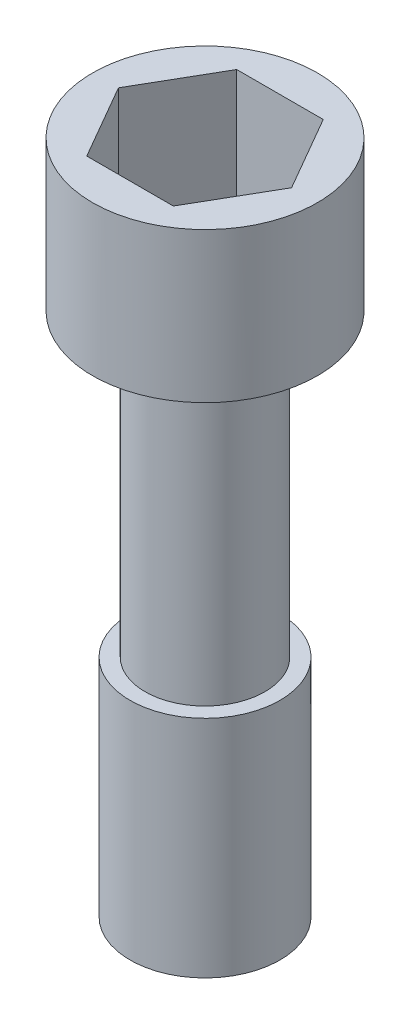
ISO-10303-21;
HEADER;
FILE_DESCRIPTION(('STEP AP214'),'2;1');
FILE_NAME('part.step','',(''),(''),'','','');
FILE_SCHEMA(('AUTOMOTIVE_DESIGN { 1 0 10303 214 1 1 1 1 }'));
ENDSEC;
DATA;
#1=APPLICATION_CONTEXT('core data for automotive mechanical design processes');
#2=APPLICATION_PROTOCOL_DEFINITION('international standard','automotive_design',2000,#1);
#3=PRODUCT_CONTEXT('',#1,'mechanical');
#4=PRODUCT('Part','Part','',(#3));
#5=PRODUCT_RELATED_PRODUCT_CATEGORY('part','',(#4));
#6=PRODUCT_DEFINITION_FORMATION('','',#4);
#7=PRODUCT_DEFINITION_CONTEXT('part definition',#1,'design');
#8=PRODUCT_DEFINITION('design','',#6,#7);
#9=PRODUCT_DEFINITION_SHAPE('','',#8);
#10=(LENGTH_UNIT() NAMED_UNIT(*) SI_UNIT(.MILLI.,.METRE.));
#11=(NAMED_UNIT(*) PLANE_ANGLE_UNIT() SI_UNIT($,.RADIAN.));
#12=(NAMED_UNIT(*) SI_UNIT($,.STERADIAN.) SOLID_ANGLE_UNIT());
#13=UNCERTAINTY_MEASURE_WITH_UNIT(LENGTH_MEASURE(1.E-05),#10,'distance_accuracy_value','');
#14=(GEOMETRIC_REPRESENTATION_CONTEXT(3) GLOBAL_UNCERTAINTY_ASSIGNED_CONTEXT((#13)) GLOBAL_UNIT_ASSIGNED_CONTEXT((#10,
#11,#12)) REPRESENTATION_CONTEXT('',''));
#15=CARTESIAN_POINT('',(0.,0.,0.));
#16=DIRECTION('',(0.,0.,1.));
#17=DIRECTION('',(1.,0.,0.));
#18=AXIS2_PLACEMENT_3D('',#15,#16,#17);
#19=CARTESIAN_POINT('',(0.,8.,0.));
#20=DIRECTION('',(0.,1.,0.));
#21=DIRECTION('',(0.,0.,1.));
#22=AXIS2_PLACEMENT_3D('',#19,#20,#21);
#23=PLANE('',#22);
#24=CARTESIAN_POINT('',(0.,8.,0.));
#25=DIRECTION('',(0.,1.,0.));
#26=DIRECTION('',(0.,0.,1.));
#27=AXIS2_PLACEMENT_3D('',#24,#25,#26);
#28=CIRCLE('',#27,7.5);
#29=CARTESIAN_POINT('',(0.,8.,7.5));
#30=VERTEX_POINT('',#29);
#31=EDGE_CURVE('E47',#30,#30,#28,.T.);
#32=ORIENTED_EDGE('',*,*,#31,.T.);
#33=EDGE_LOOP('',(#32));
#34=FACE_BOUND('',#33,.T.);
#35=DIRECTION('',(-0.500000000000001,0.,-0.866025403784438));
#36=VECTOR('',#35,1.);
#37=CARTESIAN_POINT('',(5.77350269189626,8.,0.));
#38=LINE('',#37,#36);
#39=CARTESIAN_POINT('',(5.77350269189626,8.,0.));
#40=VERTEX_POINT('',#39);
#41=CARTESIAN_POINT('',(2.88675134594812,8.,-5.00000000000001));
#42=VERTEX_POINT('',#41);
#43=EDGE_CURVE('E116',#40,#42,#38,.T.);
#44=ORIENTED_EDGE('',*,*,#43,.F.);
#45=DIRECTION('',(0.499999999999995,0.,-0.866025403784441));
#46=VECTOR('',#45,1.);
#47=CARTESIAN_POINT('',(2.88675134594819,8.,4.99999999999997));
#48=LINE('',#47,#46);
#49=CARTESIAN_POINT('',(2.88675134594819,8.,4.99999999999997));
#50=VERTEX_POINT('',#49);
#51=EDGE_CURVE('E95',#50,#40,#48,.T.);
#52=ORIENTED_EDGE('',*,*,#51,.F.);
#53=DIRECTION('',(1.,0.,0.));
#54=VECTOR('',#53,1.);
#55=CARTESIAN_POINT('',(-2.88675134594808,8.,5.00000000000003));
#56=LINE('',#55,#54);
#57=CARTESIAN_POINT('',(-2.88675134594808,8.,5.00000000000003));
#58=VERTEX_POINT('',#57);
#59=EDGE_CURVE('E66',#58,#50,#56,.T.);
#60=ORIENTED_EDGE('',*,*,#59,.F.);
#61=DIRECTION('',(0.500000000000007,0.,0.866025403784435));
#62=VECTOR('',#61,1.);
#63=CARTESIAN_POINT('',(-5.77350269189626,8.,0.));
#64=LINE('',#63,#62);
#65=CARTESIAN_POINT('',(-5.77350269189626,8.,0.));
#66=VERTEX_POINT('',#65);
#67=EDGE_CURVE('E128',#66,#58,#64,.T.);
#68=ORIENTED_EDGE('',*,*,#67,.F.);
#69=DIRECTION('',(-0.499999999999995,0.,0.866025403784441));
#70=VECTOR('',#69,1.);
#71=CARTESIAN_POINT('',(-2.88675134594815,8.,-4.99999999999999));
#72=LINE('',#71,#70);
#73=CARTESIAN_POINT('',(-2.88675134594815,8.,-4.99999999999999));
#74=VERTEX_POINT('',#73);
#75=EDGE_CURVE('E115',#74,#66,#72,.T.);
#76=ORIENTED_EDGE('',*,*,#75,.F.);
#77=DIRECTION('',(-1.,0.,0.));
#78=VECTOR('',#77,1.);
#79=CARTESIAN_POINT('',(2.88675134594812,8.,-5.00000000000001));
#80=LINE('',#79,#78);
#81=EDGE_CURVE('E104',#42,#74,#80,.T.);
#82=ORIENTED_EDGE('',*,*,#81,.F.);
#83=EDGE_LOOP('',(#44,#52,#60,#68,#76,#82));
#84=FACE_BOUND('',#83,.T.);
#85=ADVANCED_FACE('F43',(#34,#84),#23,.T.);
#86=CARTESIAN_POINT('',(0.,8.,0.));
#87=DIRECTION('',(0.,-1.,0.));
#88=DIRECTION('',(0.,0.,-1.));
#89=AXIS2_PLACEMENT_3D('',#86,#87,#88);
#90=CYLINDRICAL_SURFACE('',#89,7.5);
#91=ORIENTED_EDGE('',*,*,#31,.F.);
#92=EDGE_LOOP('',(#91));
#93=FACE_BOUND('',#92,.T.);
#94=CARTESIAN_POINT('',(0.,-2.,0.));
#95=DIRECTION('',(0.,-1.,0.));
#96=DIRECTION('',(0.,0.,-1.));
#97=AXIS2_PLACEMENT_3D('',#94,#95,#96);
#98=CIRCLE('',#97,7.5);
#99=CARTESIAN_POINT('',(0.,-2.,-7.5));
#100=VERTEX_POINT('',#99);
#101=EDGE_CURVE('E143',#100,#100,#98,.T.);
#102=ORIENTED_EDGE('',*,*,#101,.F.);
#103=EDGE_LOOP('',(#102));
#104=FACE_BOUND('',#103,.T.);
#105=ADVANCED_FACE('F45',(#93,#104),#90,.T.);
#106=CARTESIAN_POINT('',(2.88675134594819,8.,4.99999999999997));
#107=DIRECTION('',(-0.866025403784441,0.,-0.499999999999995));
#108=DIRECTION('',(-0.499999999999995,0.,0.866025403784442));
#109=AXIS2_PLACEMENT_3D('',#106,#107,#108);
#110=PLANE('',#109);
#111=DIRECTION('',(0.499999999999995,0.,-0.866025403784441));
#112=VECTOR('',#111,1.);
#113=CARTESIAN_POINT('',(2.88675134594819,0.,4.99999999999997));
#114=LINE('',#113,#112);
#115=CARTESIAN_POINT('',(2.88675134594819,0.,4.99999999999997));
#116=VERTEX_POINT('',#115);
#117=CARTESIAN_POINT('',(5.77350269189626,0.,0.));
#118=VERTEX_POINT('',#117);
#119=EDGE_CURVE('E138',#116,#118,#114,.T.);
#120=ORIENTED_EDGE('',*,*,#119,.F.);
#121=DIRECTION('',(0.,-1.,0.));
#122=VECTOR('',#121,1.);
#123=CARTESIAN_POINT('',(2.88675134594819,8.,4.99999999999997));
#124=LINE('',#123,#122);
#125=EDGE_CURVE('E137',#50,#116,#124,.T.);
#126=ORIENTED_EDGE('',*,*,#125,.F.);
#127=ORIENTED_EDGE('',*,*,#51,.T.);
#128=DIRECTION('',(0.,-1.,0.));
#129=VECTOR('',#128,1.);
#130=CARTESIAN_POINT('',(5.77350269189626,8.,0.));
#131=LINE('',#130,#129);
#132=EDGE_CURVE('E167',#40,#118,#131,.T.);
#133=ORIENTED_EDGE('',*,*,#132,.T.);
#134=EDGE_LOOP('',(#120,#126,#127,#133));
#135=FACE_BOUND('',#134,.T.);
#136=ADVANCED_FACE('F177',(#135),#110,.T.);
#137=CARTESIAN_POINT('',(5.77350269189626,8.,0.));
#138=DIRECTION('',(-0.866025403784438,0.,0.500000000000001));
#139=DIRECTION('',(0.500000000000001,0.,0.866025403784438));
#140=AXIS2_PLACEMENT_3D('',#137,#138,#139);
#141=PLANE('',#140);
#142=DIRECTION('',(-0.500000000000001,0.,-0.866025403784438));
#143=VECTOR('',#142,1.);
#144=CARTESIAN_POINT('',(5.77350269189626,0.,0.));
#145=LINE('',#144,#143);
#146=CARTESIAN_POINT('',(2.88675134594812,0.,-5.00000000000001));
#147=VERTEX_POINT('',#146);
#148=EDGE_CURVE('E142',#118,#147,#145,.T.);
#149=ORIENTED_EDGE('',*,*,#148,.F.);
#150=ORIENTED_EDGE('',*,*,#132,.F.);
#151=ORIENTED_EDGE('',*,*,#43,.T.);
#152=DIRECTION('',(0.,-1.,0.));
#153=VECTOR('',#152,1.);
#154=CARTESIAN_POINT('',(2.88675134594812,8.,-5.00000000000001));
#155=LINE('',#154,#153);
#156=EDGE_CURVE('E110',#42,#147,#155,.T.);
#157=ORIENTED_EDGE('',*,*,#156,.T.);
#158=EDGE_LOOP('',(#149,#150,#151,#157));
#159=FACE_BOUND('',#158,.T.);
#160=ADVANCED_FACE('F192',(#159),#141,.T.);
#161=CARTESIAN_POINT('',(2.88675134594812,8.,-5.00000000000001));
#162=DIRECTION('',(0.,0.,1.));
#163=DIRECTION('',(1.,0.,0.));
#164=AXIS2_PLACEMENT_3D('',#161,#162,#163);
#165=PLANE('',#164);
#166=DIRECTION('',(-1.,0.,0.));
#167=VECTOR('',#166,1.);
#168=CARTESIAN_POINT('',(2.88675134594812,0.,-5.00000000000001));
#169=LINE('',#168,#167);
#170=CARTESIAN_POINT('',(-2.88675134594815,0.,-4.99999999999999));
#171=VERTEX_POINT('',#170);
#172=EDGE_CURVE('E147',#147,#171,#169,.T.);
#173=ORIENTED_EDGE('',*,*,#172,.F.);
#174=ORIENTED_EDGE('',*,*,#156,.F.);
#175=ORIENTED_EDGE('',*,*,#81,.T.);
#176=DIRECTION('',(0.,-1.,0.));
#177=VECTOR('',#176,1.);
#178=CARTESIAN_POINT('',(-2.88675134594815,8.,-4.99999999999999));
#179=LINE('',#178,#177);
#180=EDGE_CURVE('E108',#74,#171,#179,.T.);
#181=ORIENTED_EDGE('',*,*,#180,.T.);
#182=EDGE_LOOP('',(#173,#174,#175,#181));
#183=FACE_BOUND('',#182,.T.);
#184=ADVANCED_FACE('F107',(#183),#165,.T.);
#185=CARTESIAN_POINT('',(-2.88675134594815,8.,-4.99999999999999));
#186=DIRECTION('',(0.866025403784442,0.,0.499999999999995));
#187=DIRECTION('',(0.499999999999995,0.,-0.866025403784442));
#188=AXIS2_PLACEMENT_3D('',#185,#186,#187);
#189=PLANE('',#188);
#190=DIRECTION('',(-0.499999999999995,0.,0.866025403784441));
#191=VECTOR('',#190,1.);
#192=CARTESIAN_POINT('',(-2.88675134594815,0.,-4.99999999999999));
#193=LINE('',#192,#191);
#194=CARTESIAN_POINT('',(-5.77350269189626,0.,0.));
#195=VERTEX_POINT('',#194);
#196=EDGE_CURVE('E122',#171,#195,#193,.T.);
#197=ORIENTED_EDGE('',*,*,#196,.F.);
#198=ORIENTED_EDGE('',*,*,#180,.F.);
#199=ORIENTED_EDGE('',*,*,#75,.T.);
#200=DIRECTION('',(0.,-1.,0.));
#201=VECTOR('',#200,1.);
#202=CARTESIAN_POINT('',(-5.77350269189626,8.,0.));
#203=LINE('',#202,#201);
#204=EDGE_CURVE('E125',#66,#195,#203,.T.);
#205=ORIENTED_EDGE('',*,*,#204,.T.);
#206=EDGE_LOOP('',(#197,#198,#199,#205));
#207=FACE_BOUND('',#206,.T.);
#208=ADVANCED_FACE('F119',(#207),#189,.T.);
#209=CARTESIAN_POINT('',(-5.77350269189626,8.,0.));
#210=DIRECTION('',(0.866025403784435,0.,-0.500000000000007));
#211=DIRECTION('',(-0.500000000000007,0.,-0.866025403784435));
#212=AXIS2_PLACEMENT_3D('',#209,#210,#211);
#213=PLANE('',#212);
#214=DIRECTION('',(0.500000000000007,0.,0.866025403784435));
#215=VECTOR('',#214,1.);
#216=CARTESIAN_POINT('',(-5.77350269189626,0.,0.));
#217=LINE('',#216,#215);
#218=CARTESIAN_POINT('',(-2.88675134594808,0.,5.00000000000003));
#219=VERTEX_POINT('',#218);
#220=EDGE_CURVE('E152',#195,#219,#217,.T.);
#221=ORIENTED_EDGE('',*,*,#220,.F.);
#222=ORIENTED_EDGE('',*,*,#204,.F.);
#223=ORIENTED_EDGE('',*,*,#67,.T.);
#224=DIRECTION('',(0.,-1.,0.));
#225=VECTOR('',#224,1.);
#226=CARTESIAN_POINT('',(-2.88675134594808,8.,5.00000000000003));
#227=LINE('',#226,#225);
#228=EDGE_CURVE('E60',#58,#219,#227,.T.);
#229=ORIENTED_EDGE('',*,*,#228,.T.);
#230=EDGE_LOOP('',(#221,#222,#223,#229));
#231=FACE_BOUND('',#230,.T.);
#232=ADVANCED_FACE('F196',(#231),#213,.T.);
#233=CARTESIAN_POINT('',(-2.88675134594808,8.,5.00000000000003));
#234=DIRECTION('',(0.,0.,-1.));
#235=DIRECTION('',(-1.,0.,0.));
#236=AXIS2_PLACEMENT_3D('',#233,#234,#235);
#237=PLANE('',#236);
#238=DIRECTION('',(1.,0.,0.));
#239=VECTOR('',#238,1.);
#240=CARTESIAN_POINT('',(-2.88675134594808,0.,5.00000000000003));
#241=LINE('',#240,#239);
#242=EDGE_CURVE('E156',#219,#116,#241,.T.);
#243=ORIENTED_EDGE('',*,*,#242,.F.);
#244=ORIENTED_EDGE('',*,*,#228,.F.);
#245=ORIENTED_EDGE('',*,*,#59,.T.);
#246=ORIENTED_EDGE('',*,*,#125,.T.);
#247=EDGE_LOOP('',(#243,#244,#245,#246));
#248=FACE_BOUND('',#247,.T.);
#249=ADVANCED_FACE('F195',(#248),#237,.T.);
#250=CARTESIAN_POINT('',(0.,0.,0.));
#251=DIRECTION('',(0.,-1.,0.));
#252=DIRECTION('',(0.,0.,-1.));
#253=AXIS2_PLACEMENT_3D('',#250,#251,#252);
#254=PLANE('',#253);
#255=ORIENTED_EDGE('',*,*,#242,.T.);
#256=ORIENTED_EDGE('',*,*,#119,.T.);
#257=ORIENTED_EDGE('',*,*,#148,.T.);
#258=ORIENTED_EDGE('',*,*,#172,.T.);
#259=ORIENTED_EDGE('',*,*,#196,.T.);
#260=ORIENTED_EDGE('',*,*,#220,.T.);
#261=EDGE_LOOP('',(#255,#256,#257,#258,#259,#260));
#262=FACE_BOUND('',#261,.T.);
#263=ADVANCED_FACE('F194',(#262),#254,.F.);
#264=CARTESIAN_POINT('',(0.,-2.,0.));
#265=DIRECTION('',(0.,-1.,0.));
#266=DIRECTION('',(0.,0.,-1.));
#267=AXIS2_PLACEMENT_3D('',#264,#265,#266);
#268=PLANE('',#267);
#269=CARTESIAN_POINT('',(0.,-2.,0.));
#270=DIRECTION('',(0.,-1.,0.));
#271=DIRECTION('',(0.,0.,-1.));
#272=AXIS2_PLACEMENT_3D('',#269,#270,#271);
#273=CIRCLE('',#272,4.);
#274=CARTESIAN_POINT('',(0.,-2.,-4.));
#275=VERTEX_POINT('',#274);
#276=EDGE_CURVE('E11',#275,#275,#273,.T.);
#277=ORIENTED_EDGE('',*,*,#276,.F.);
#278=EDGE_LOOP('',(#277));
#279=FACE_BOUND('',#278,.T.);
#280=ORIENTED_EDGE('',*,*,#101,.T.);
#281=EDGE_LOOP('',(#280));
#282=FACE_BOUND('',#281,.T.);
#283=ADVANCED_FACE('F245',(#279,#282),#268,.T.);
#284=CARTESIAN_POINT('',(0.,-22.,0.));
#285=DIRECTION('',(0.,1.,0.));
#286=DIRECTION('',(0.,0.,1.));
#287=AXIS2_PLACEMENT_3D('',#284,#285,#286);
#288=CYLINDRICAL_SURFACE('',#287,4.);
#289=CARTESIAN_POINT('',(0.,-22.,0.));
#290=DIRECTION('',(0.,-1.,0.));
#291=DIRECTION('',(0.,0.,-1.));
#292=AXIS2_PLACEMENT_3D('',#289,#290,#291);
#293=CIRCLE('',#292,4.);
#294=CARTESIAN_POINT('',(0.,-22.,-4.));
#295=VERTEX_POINT('',#294);
#296=EDGE_CURVE('E182',#295,#295,#293,.T.);
#297=ORIENTED_EDGE('',*,*,#296,.F.);
#298=EDGE_LOOP('',(#297));
#299=FACE_BOUND('',#298,.T.);
#300=ORIENTED_EDGE('',*,*,#276,.T.);
#301=EDGE_LOOP('',(#300));
#302=FACE_BOUND('',#301,.T.);
#303=ADVANCED_FACE('F255',(#299,#302),#288,.T.);
#304=CARTESIAN_POINT('',(0.,-37.,0.));
#305=DIRECTION('',(0.,1.,0.));
#306=DIRECTION('',(0.,0.,1.));
#307=AXIS2_PLACEMENT_3D('',#304,#305,#306);
#308=CYLINDRICAL_SURFACE('',#307,5.);
#309=CARTESIAN_POINT('',(0.,-37.,0.));
#310=DIRECTION('',(0.,-1.,0.));
#311=DIRECTION('',(0.,0.,-1.));
#312=AXIS2_PLACEMENT_3D('',#309,#310,#311);
#313=CIRCLE('',#312,5.);
#314=CARTESIAN_POINT('',(0.,-37.,-5.));
#315=VERTEX_POINT('',#314);
#316=EDGE_CURVE('E186',#315,#315,#313,.T.);
#317=ORIENTED_EDGE('',*,*,#316,.F.);
#318=EDGE_LOOP('',(#317));
#319=FACE_BOUND('',#318,.T.);
#320=CARTESIAN_POINT('',(0.,-22.,0.));
#321=DIRECTION('',(0.,-1.,0.));
#322=DIRECTION('',(0.,0.,-1.));
#323=AXIS2_PLACEMENT_3D('',#320,#321,#322);
#324=CIRCLE('',#323,5.);
#325=CARTESIAN_POINT('',(0.,-22.,-5.));
#326=VERTEX_POINT('',#325);
#327=EDGE_CURVE('E351',#326,#326,#324,.T.);
#328=ORIENTED_EDGE('',*,*,#327,.T.);
#329=EDGE_LOOP('',(#328));
#330=FACE_BOUND('',#329,.T.);
#331=ADVANCED_FACE('F266',(#319,#330),#308,.T.);
#332=CARTESIAN_POINT('',(0.,-37.,0.));
#333=DIRECTION('',(0.,-1.,0.));
#334=DIRECTION('',(0.,0.,-1.));
#335=AXIS2_PLACEMENT_3D('',#332,#333,#334);
#336=PLANE('',#335);
#337=ORIENTED_EDGE('',*,*,#316,.T.);
#338=EDGE_LOOP('',(#337));
#339=FACE_BOUND('',#338,.T.);
#340=ADVANCED_FACE('F277',(#339),#336,.T.);
#341=CARTESIAN_POINT('',(0.,-22.,0.));
#342=DIRECTION('',(0.,-1.,0.));
#343=DIRECTION('',(0.,0.,-1.));
#344=AXIS2_PLACEMENT_3D('',#341,#342,#343);
#345=PLANE('',#344);
#346=ORIENTED_EDGE('',*,*,#296,.T.);
#347=EDGE_LOOP('',(#346));
#348=FACE_BOUND('',#347,.T.);
#349=ORIENTED_EDGE('',*,*,#327,.F.);
#350=EDGE_LOOP('',(#349));
#351=FACE_BOUND('',#350,.T.);
#352=ADVANCED_FACE('F288',(#348,#351),#345,.F.);
#353=CLOSED_SHELL('',(#85,#105,#136,#160,#184,#208,#232,#249,#263,#283,#303,#331,#340,#352));
#354=MANIFOLD_SOLID_BREP('B2',#353);
#355=ADVANCED_BREP_SHAPE_REPRESENTATION('',(#18,#354),#14);
#356=SHAPE_DEFINITION_REPRESENTATION(#9,#355);
ENDSEC;
END-ISO-10303-21;
